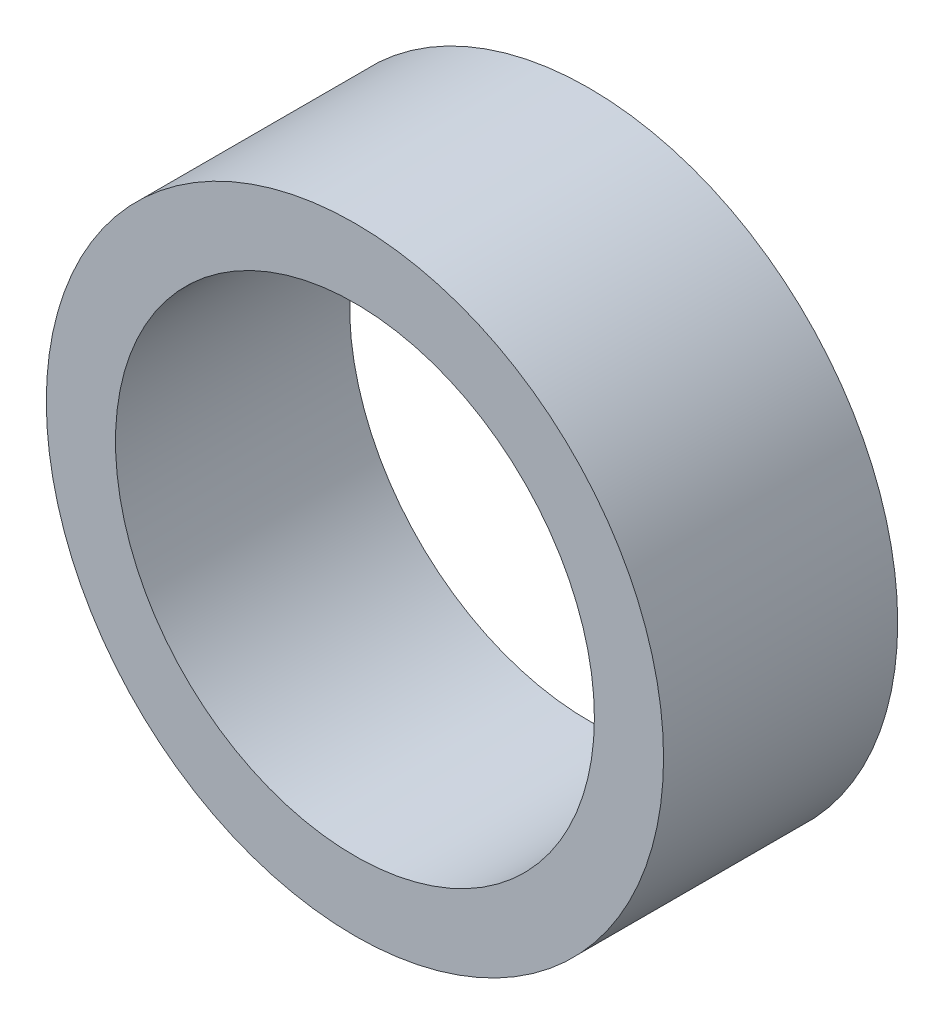
ISO-10303-21;
HEADER;
FILE_DESCRIPTION(('STEP AP214'),'2;1');
FILE_NAME('part.step','',(''),(''),'','','');
FILE_SCHEMA(('AUTOMOTIVE_DESIGN { 1 0 10303 214 1 1 1 1 }'));
ENDSEC;
DATA;
#1=APPLICATION_CONTEXT('core data for automotive mechanical design processes');
#2=APPLICATION_PROTOCOL_DEFINITION('international standard','automotive_design',2000,#1);
#3=PRODUCT_CONTEXT('',#1,'mechanical');
#4=PRODUCT('Part','Part','',(#3));
#5=PRODUCT_RELATED_PRODUCT_CATEGORY('part','',(#4));
#6=PRODUCT_DEFINITION_FORMATION('','',#4);
#7=PRODUCT_DEFINITION_CONTEXT('part definition',#1,'design');
#8=PRODUCT_DEFINITION('design','',#6,#7);
#9=PRODUCT_DEFINITION_SHAPE('','',#8);
#10=(LENGTH_UNIT() NAMED_UNIT(*) SI_UNIT(.MILLI.,.METRE.));
#11=(NAMED_UNIT(*) PLANE_ANGLE_UNIT() SI_UNIT($,.RADIAN.));
#12=(NAMED_UNIT(*) SI_UNIT($,.STERADIAN.) SOLID_ANGLE_UNIT());
#13=UNCERTAINTY_MEASURE_WITH_UNIT(LENGTH_MEASURE(1.E-05),#10,'distance_accuracy_value','');
#14=(GEOMETRIC_REPRESENTATION_CONTEXT(3) GLOBAL_UNCERTAINTY_ASSIGNED_CONTEXT((#13)) GLOBAL_UNIT_ASSIGNED_CONTEXT((#10,
#11,#12)) REPRESENTATION_CONTEXT('',''));
#15=CARTESIAN_POINT('',(0.,0.,0.));
#16=DIRECTION('',(0.,0.,1.));
#17=DIRECTION('',(1.,0.,0.));
#18=AXIS2_PLACEMENT_3D('',#15,#16,#17);
#19=CARTESIAN_POINT('',(0.,0.,22.));
#20=DIRECTION('',(0.,0.,1.));
#21=DIRECTION('',(1.,0.,0.));
#22=AXIS2_PLACEMENT_3D('',#19,#20,#21);
#23=PLANE('',#22);
#24=CARTESIAN_POINT('',(0.,0.,22.));
#25=DIRECTION('',(0.,0.,1.));
#26=DIRECTION('',(1.,0.,0.));
#27=AXIS2_PLACEMENT_3D('',#24,#25,#26);
#28=CIRCLE('',#27,29.);
#29=CARTESIAN_POINT('',(29.,0.,22.));
#30=VERTEX_POINT('',#29);
#31=EDGE_CURVE('E10',#30,#30,#28,.T.);
#32=ORIENTED_EDGE('',*,*,#31,.T.);
#33=EDGE_LOOP('',(#32));
#34=FACE_BOUND('',#33,.T.);
#35=CARTESIAN_POINT('',(0.,0.,22.));
#36=DIRECTION('',(0.,0.,1.));
#37=DIRECTION('',(1.,0.,0.));
#38=AXIS2_PLACEMENT_3D('',#35,#36,#37);
#39=CIRCLE('',#38,22.5);
#40=CARTESIAN_POINT('',(22.5,0.,22.));
#41=VERTEX_POINT('',#40);
#42=EDGE_CURVE('E41',#41,#41,#39,.T.);
#43=ORIENTED_EDGE('',*,*,#42,.F.);
#44=EDGE_LOOP('',(#43));
#45=FACE_BOUND('',#44,.T.);
#46=ADVANCED_FACE('F30',(#34,#45),#23,.T.);
#47=CARTESIAN_POINT('',(0.,0.,0.));
#48=DIRECTION('',(0.,0.,1.));
#49=DIRECTION('',(1.,0.,0.));
#50=AXIS2_PLACEMENT_3D('',#47,#48,#49);
#51=PLANE('',#50);
#52=CARTESIAN_POINT('',(0.,0.,0.));
#53=DIRECTION('',(0.,0.,1.));
#54=DIRECTION('',(1.,0.,0.));
#55=AXIS2_PLACEMENT_3D('',#52,#53,#54);
#56=CIRCLE('',#55,29.);
#57=CARTESIAN_POINT('',(29.,0.,0.));
#58=VERTEX_POINT('',#57);
#59=EDGE_CURVE('E34',#58,#58,#56,.T.);
#60=ORIENTED_EDGE('',*,*,#59,.F.);
#61=EDGE_LOOP('',(#60));
#62=FACE_BOUND('',#61,.T.);
#63=CARTESIAN_POINT('',(0.,0.,0.));
#64=DIRECTION('',(0.,0.,1.));
#65=DIRECTION('',(1.,0.,0.));
#66=AXIS2_PLACEMENT_3D('',#63,#64,#65);
#67=CIRCLE('',#66,22.5);
#68=CARTESIAN_POINT('',(22.5,0.,0.));
#69=VERTEX_POINT('',#68);
#70=EDGE_CURVE('E43',#69,#69,#67,.T.);
#71=ORIENTED_EDGE('',*,*,#70,.T.);
#72=EDGE_LOOP('',(#71));
#73=FACE_BOUND('',#72,.T.);
#74=ADVANCED_FACE('F53',(#62,#73),#51,.F.);
#75=CARTESIAN_POINT('',(0.,0.,22.));
#76=DIRECTION('',(0.,0.,-1.));
#77=DIRECTION('',(-1.,0.,0.));
#78=AXIS2_PLACEMENT_3D('',#75,#76,#77);
#79=CYLINDRICAL_SURFACE('',#78,29.);
#80=ORIENTED_EDGE('',*,*,#31,.F.);
#81=EDGE_LOOP('',(#80));
#82=FACE_BOUND('',#81,.T.);
#83=ORIENTED_EDGE('',*,*,#59,.T.);
#84=EDGE_LOOP('',(#83));
#85=FACE_BOUND('',#84,.T.);
#86=ADVANCED_FACE('F32',(#82,#85),#79,.T.);
#87=CARTESIAN_POINT('',(0.,0.,22.));
#88=DIRECTION('',(0.,0.,-1.));
#89=DIRECTION('',(-1.,0.,0.));
#90=AXIS2_PLACEMENT_3D('',#87,#88,#89);
#91=CYLINDRICAL_SURFACE('',#90,22.5);
#92=ORIENTED_EDGE('',*,*,#42,.T.);
#93=EDGE_LOOP('',(#92));
#94=FACE_BOUND('',#93,.T.);
#95=ORIENTED_EDGE('',*,*,#70,.F.);
#96=EDGE_LOOP('',(#95));
#97=FACE_BOUND('',#96,.T.);
#98=ADVANCED_FACE('F49',(#94,#97),#91,.F.);
#99=CLOSED_SHELL('',(#46,#74,#86,#98));
#100=MANIFOLD_SOLID_BREP('B2',#99);
#101=ADVANCED_BREP_SHAPE_REPRESENTATION('',(#18,#100),#14);
#102=SHAPE_DEFINITION_REPRESENTATION(#9,#101);
ENDSEC;
END-ISO-10303-21;
